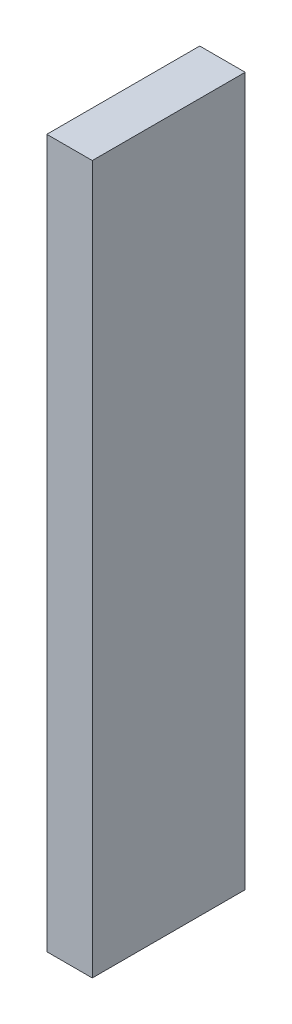
ISO-10303-21;
HEADER;
FILE_DESCRIPTION(('STEP AP214'),'2;1');
FILE_NAME('part.step','',(''),(''),'','','');
FILE_SCHEMA(('AUTOMOTIVE_DESIGN { 1 0 10303 214 1 1 1 1 }'));
ENDSEC;
DATA;
#1=APPLICATION_CONTEXT('core data for automotive mechanical design processes');
#2=APPLICATION_PROTOCOL_DEFINITION('international standard','automotive_design',2000,#1);
#3=PRODUCT_CONTEXT('',#1,'mechanical');
#4=PRODUCT('Part','Part','',(#3));
#5=PRODUCT_RELATED_PRODUCT_CATEGORY('part','',(#4));
#6=PRODUCT_DEFINITION_FORMATION('','',#4);
#7=PRODUCT_DEFINITION_CONTEXT('part definition',#1,'design');
#8=PRODUCT_DEFINITION('design','',#6,#7);
#9=PRODUCT_DEFINITION_SHAPE('','',#8);
#10=(LENGTH_UNIT() NAMED_UNIT(*) SI_UNIT(.MILLI.,.METRE.));
#11=(NAMED_UNIT(*) PLANE_ANGLE_UNIT() SI_UNIT($,.RADIAN.));
#12=(NAMED_UNIT(*) SI_UNIT($,.STERADIAN.) SOLID_ANGLE_UNIT());
#13=UNCERTAINTY_MEASURE_WITH_UNIT(LENGTH_MEASURE(1.E-05),#10,'distance_accuracy_value','');
#14=(GEOMETRIC_REPRESENTATION_CONTEXT(3) GLOBAL_UNCERTAINTY_ASSIGNED_CONTEXT((#13)) GLOBAL_UNIT_ASSIGNED_CONTEXT((#10,
#11,#12)) REPRESENTATION_CONTEXT('',''));
#15=CARTESIAN_POINT('',(0.,0.,0.));
#16=DIRECTION('',(0.,0.,1.));
#17=DIRECTION('',(1.,0.,0.));
#18=AXIS2_PLACEMENT_3D('',#15,#16,#17);
#19=CARTESIAN_POINT('',(130.275545220941,22.4180708263693,81.072028202897));
#20=DIRECTION('',(-1.69244514382854E-09,0.,1.));
#21=DIRECTION('',(1.,0.,1.69244514382854E-09));
#22=AXIS2_PLACEMENT_3D('',#19,#20,#21);
#23=PLANE('',#22);
#24=DIRECTION('',(0.,-1.,0.));
#25=VECTOR('',#24,1.);
#26=CARTESIAN_POINT('',(131.258630317954,22.4180708263693,81.0720282045608));
#27=LINE('',#26,#25);
#28=CARTESIAN_POINT('',(131.258630317954,22.4180708263693,81.0720282045608));
#29=VERTEX_POINT('',#28);
#30=CARTESIAN_POINT('',(131.258630317954,7.11212965552236,81.0720282045608));
#31=VERTEX_POINT('',#30);
#32=EDGE_CURVE('E79',#29,#31,#27,.T.);
#33=ORIENTED_EDGE('',*,*,#32,.F.);
#34=DIRECTION('',(1.,0.,1.69244514382854E-09));
#35=VECTOR('',#34,1.);
#36=CARTESIAN_POINT('',(130.275545220941,22.4180708263693,81.072028202897));
#37=LINE('',#36,#35);
#38=CARTESIAN_POINT('',(130.275545220941,22.4180708263693,81.072028202897));
#39=VERTEX_POINT('',#38);
#40=EDGE_CURVE('E32',#39,#29,#37,.T.);
#41=ORIENTED_EDGE('',*,*,#40,.F.);
#42=DIRECTION('',(0.,-1.,0.));
#43=VECTOR('',#42,1.);
#44=CARTESIAN_POINT('',(130.275545220941,22.4180708263693,81.072028202897));
#45=LINE('',#44,#43);
#46=CARTESIAN_POINT('',(130.275545220941,7.11212965552236,81.0720282028969));
#47=VERTEX_POINT('',#46);
#48=EDGE_CURVE('E71',#39,#47,#45,.T.);
#49=ORIENTED_EDGE('',*,*,#48,.T.);
#50=DIRECTION('',(1.,0.,1.69244514382854E-09));
#51=VECTOR('',#50,1.);
#52=CARTESIAN_POINT('',(130.275545220941,7.11212965552236,81.0720282028969));
#53=LINE('',#52,#51);
#54=EDGE_CURVE('E10',#47,#31,#53,.T.);
#55=ORIENTED_EDGE('',*,*,#54,.T.);
#56=EDGE_LOOP('',(#33,#41,#49,#55));
#57=FACE_BOUND('',#56,.T.);
#58=ADVANCED_FACE('F16',(#57),#23,.T.);
#59=CARTESIAN_POINT('',(130.275545220941,7.11212965552236,81.0720282028969));
#60=DIRECTION('',(0.,-1.,0.));
#61=DIRECTION('',(0.,0.,-1.));
#62=AXIS2_PLACEMENT_3D('',#59,#60,#61);
#63=PLANE('',#62);
#64=DIRECTION('',(1.69244514382854E-09,0.,-1.));
#65=VECTOR('',#64,1.);
#66=CARTESIAN_POINT('',(131.258630317954,7.11212965552236,81.0720282045608));
#67=LINE('',#66,#65);
#68=CARTESIAN_POINT('',(131.258630323549,7.11212965552235,77.766087033712));
#69=VERTEX_POINT('',#68);
#70=EDGE_CURVE('E82',#31,#69,#67,.T.);
#71=ORIENTED_EDGE('',*,*,#70,.F.);
#72=ORIENTED_EDGE('',*,*,#54,.F.);
#73=DIRECTION('',(1.69244514382854E-09,0.,-1.));
#74=VECTOR('',#73,1.);
#75=CARTESIAN_POINT('',(130.275545220941,7.11212965552236,81.0720282028969));
#76=LINE('',#75,#74);
#77=CARTESIAN_POINT('',(130.275545226536,7.11212965552235,77.7660870320482));
#78=VERTEX_POINT('',#77);
#79=EDGE_CURVE('E67',#47,#78,#76,.T.);
#80=ORIENTED_EDGE('',*,*,#79,.T.);
#81=DIRECTION('',(1.,0.,1.69244514382854E-09));
#82=VECTOR('',#81,1.);
#83=CARTESIAN_POINT('',(130.275545226536,7.11212965552235,77.7660870320482));
#84=LINE('',#83,#82);
#85=EDGE_CURVE('E24',#78,#69,#84,.T.);
#86=ORIENTED_EDGE('',*,*,#85,.T.);
#87=EDGE_LOOP('',(#71,#72,#80,#86));
#88=FACE_BOUND('',#87,.T.);
#89=ADVANCED_FACE('F68',(#88),#63,.T.);
#90=CARTESIAN_POINT('',(130.275545226536,7.11212965552235,77.7660870320482));
#91=DIRECTION('',(1.69244514382854E-09,0.,-1.));
#92=DIRECTION('',(-1.,0.,-1.69244514382854E-09));
#93=AXIS2_PLACEMENT_3D('',#90,#91,#92);
#94=PLANE('',#93);
#95=DIRECTION('',(0.,1.,0.));
#96=VECTOR('',#95,1.);
#97=CARTESIAN_POINT('',(131.258630323549,7.11212965552235,77.766087033712));
#98=LINE('',#97,#96);
#99=CARTESIAN_POINT('',(131.258630323549,22.418070826371,77.7660870252515));
#100=VERTEX_POINT('',#99);
#101=EDGE_CURVE('E65',#69,#100,#98,.T.);
#102=ORIENTED_EDGE('',*,*,#101,.F.);
#103=ORIENTED_EDGE('',*,*,#85,.F.);
#104=DIRECTION('',(0.,1.,0.));
#105=VECTOR('',#104,1.);
#106=CARTESIAN_POINT('',(130.275545226536,7.11212965552235,77.7660870320482));
#107=LINE('',#106,#105);
#108=CARTESIAN_POINT('',(130.275545226536,22.418070826371,77.7660870235877));
#109=VERTEX_POINT('',#108);
#110=EDGE_CURVE('E62',#78,#109,#107,.T.);
#111=ORIENTED_EDGE('',*,*,#110,.T.);
#112=DIRECTION('',(1.,0.,1.69244514382854E-09));
#113=VECTOR('',#112,1.);
#114=CARTESIAN_POINT('',(130.275545226536,22.418070826371,77.7660870235877));
#115=LINE('',#114,#113);
#116=EDGE_CURVE('E48',#109,#100,#115,.T.);
#117=ORIENTED_EDGE('',*,*,#116,.T.);
#118=EDGE_LOOP('',(#102,#103,#111,#117));
#119=FACE_BOUND('',#118,.T.);
#120=ADVANCED_FACE('F60',(#119),#94,.T.);
#121=CARTESIAN_POINT('',(130.275545226536,22.418070826371,77.7660870235877));
#122=DIRECTION('',(0.,1.,0.));
#123=DIRECTION('',(-1.,0.,0.));
#124=AXIS2_PLACEMENT_3D('',#121,#122,#123);
#125=PLANE('',#124);
#126=DIRECTION('',(-1.69244514382854E-09,0.,1.));
#127=VECTOR('',#126,1.);
#128=CARTESIAN_POINT('',(131.258630323549,22.418070826371,77.7660870252515));
#129=LINE('',#128,#127);
#130=EDGE_CURVE('E85',#100,#29,#129,.T.);
#131=ORIENTED_EDGE('',*,*,#130,.F.);
#132=ORIENTED_EDGE('',*,*,#116,.F.);
#133=DIRECTION('',(-1.69244514382854E-09,0.,1.));
#134=VECTOR('',#133,1.);
#135=CARTESIAN_POINT('',(130.275545226536,22.418070826371,77.7660870235877));
#136=LINE('',#135,#134);
#137=EDGE_CURVE('E74',#109,#39,#136,.T.);
#138=ORIENTED_EDGE('',*,*,#137,.T.);
#139=ORIENTED_EDGE('',*,*,#40,.T.);
#140=EDGE_LOOP('',(#131,#132,#138,#139));
#141=FACE_BOUND('',#140,.T.);
#142=ADVANCED_FACE('F96',(#141),#125,.T.);
#143=CARTESIAN_POINT('',(130.275545201028,17.2651002409467,92.8378644340291));
#144=DIRECTION('',(1.,0.,1.69244514382854E-09));
#145=DIRECTION('',(0.,1.,0.));
#146=AXIS2_PLACEMENT_3D('',#143,#144,#145);
#147=PLANE('',#146);
#148=ORIENTED_EDGE('',*,*,#48,.F.);
#149=ORIENTED_EDGE('',*,*,#137,.F.);
#150=ORIENTED_EDGE('',*,*,#110,.F.);
#151=ORIENTED_EDGE('',*,*,#79,.F.);
#152=EDGE_LOOP('',(#148,#149,#150,#151));
#153=FACE_BOUND('',#152,.T.);
#154=ADVANCED_FACE('F73',(#153),#147,.F.);
#155=CARTESIAN_POINT('',(131.258630298041,17.2651002409467,92.8378644356929));
#156=DIRECTION('',(1.,0.,1.69244514382854E-09));
#157=DIRECTION('',(0.,1.,0.));
#158=AXIS2_PLACEMENT_3D('',#155,#156,#157);
#159=PLANE('',#158);
#160=ORIENTED_EDGE('',*,*,#32,.T.);
#161=ORIENTED_EDGE('',*,*,#70,.T.);
#162=ORIENTED_EDGE('',*,*,#101,.T.);
#163=ORIENTED_EDGE('',*,*,#130,.T.);
#164=EDGE_LOOP('',(#160,#161,#162,#163));
#165=FACE_BOUND('',#164,.T.);
#166=ADVANCED_FACE('F89',(#165),#159,.T.);
#167=CLOSED_SHELL('',(#58,#89,#120,#142,#154,#166));
#168=MANIFOLD_SOLID_BREP('B1',#167);
#169=ADVANCED_BREP_SHAPE_REPRESENTATION('',(#18,#168),#14);
#170=SHAPE_DEFINITION_REPRESENTATION(#9,#169);
ENDSEC;
END-ISO-10303-21;
